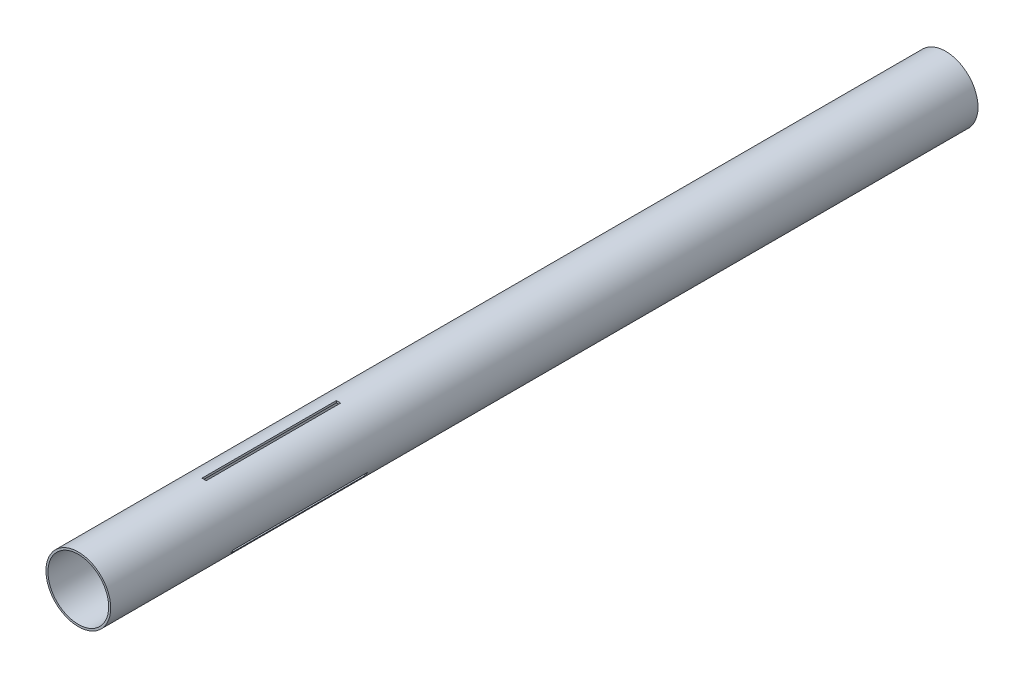
ISO-10303-21;
HEADER;
FILE_DESCRIPTION(('STEP AP214'),'2;1');
FILE_NAME('part.step','',(''),(''),'','','');
FILE_SCHEMA(('AUTOMOTIVE_DESIGN { 1 0 10303 214 1 1 1 1 }'));
ENDSEC;
DATA;
#1=APPLICATION_CONTEXT('core data for automotive mechanical design processes');
#2=APPLICATION_PROTOCOL_DEFINITION('international standard','automotive_design',2000,#1);
#3=PRODUCT_CONTEXT('',#1,'mechanical');
#4=PRODUCT('Part','Part','',(#3));
#5=PRODUCT_RELATED_PRODUCT_CATEGORY('part','',(#4));
#6=PRODUCT_DEFINITION_FORMATION('','',#4);
#7=PRODUCT_DEFINITION_CONTEXT('part definition',#1,'design');
#8=PRODUCT_DEFINITION('design','',#6,#7);
#9=PRODUCT_DEFINITION_SHAPE('','',#8);
#10=(LENGTH_UNIT() NAMED_UNIT(*) SI_UNIT(.MILLI.,.METRE.));
#11=(NAMED_UNIT(*) PLANE_ANGLE_UNIT() SI_UNIT($,.RADIAN.));
#12=(NAMED_UNIT(*) SI_UNIT($,.STERADIAN.) SOLID_ANGLE_UNIT());
#13=UNCERTAINTY_MEASURE_WITH_UNIT(LENGTH_MEASURE(1.E-05),#10,'distance_accuracy_value','');
#14=(GEOMETRIC_REPRESENTATION_CONTEXT(3) GLOBAL_UNCERTAINTY_ASSIGNED_CONTEXT((#13)) GLOBAL_UNIT_ASSIGNED_CONTEXT((#10,
#11,#12)) REPRESENTATION_CONTEXT('',''));
#15=CARTESIAN_POINT('',(0.,0.,0.));
#16=DIRECTION('',(0.,0.,1.));
#17=DIRECTION('',(1.,0.,0.));
#18=AXIS2_PLACEMENT_3D('',#15,#16,#17);
#19=CARTESIAN_POINT('',(0.,0.,635.));
#20=DIRECTION('',(0.,0.,1.));
#21=DIRECTION('',(1.,0.,0.));
#22=AXIS2_PLACEMENT_3D('',#19,#20,#21);
#23=PLANE('',#22);
#24=CARTESIAN_POINT('',(0.,0.,635.));
#25=DIRECTION('',(0.,0.,1.));
#26=DIRECTION('',(1.,0.,0.));
#27=AXIS2_PLACEMENT_3D('',#24,#25,#26);
#28=CIRCLE('',#27,23.6982);
#29=CARTESIAN_POINT('',(23.6982,0.,635.));
#30=VERTEX_POINT('',#29);
#31=EDGE_CURVE('E11',#30,#30,#28,.T.);
#32=ORIENTED_EDGE('',*,*,#31,.T.);
#33=EDGE_LOOP('',(#32));
#34=FACE_BOUND('',#33,.T.);
#35=CARTESIAN_POINT('',(0.,0.,635.));
#36=DIRECTION('',(0.,0.,1.));
#37=DIRECTION('',(1.,0.,0.));
#38=AXIS2_PLACEMENT_3D('',#35,#36,#37);
#39=CIRCLE('',#38,22.225);
#40=CARTESIAN_POINT('',(22.225,0.,635.));
#41=VERTEX_POINT('',#40);
#42=EDGE_CURVE('E225',#41,#41,#39,.T.);
#43=ORIENTED_EDGE('',*,*,#42,.F.);
#44=EDGE_LOOP('',(#43));
#45=FACE_BOUND('',#44,.T.);
#46=ADVANCED_FACE('F33',(#34,#45),#23,.T.);
#47=CARTESIAN_POINT('',(0.,0.,0.));
#48=DIRECTION('',(0.,0.,1.));
#49=DIRECTION('',(1.,0.,0.));
#50=AXIS2_PLACEMENT_3D('',#47,#48,#49);
#51=PLANE('',#50);
#52=CARTESIAN_POINT('',(0.,0.,0.));
#53=DIRECTION('',(0.,0.,1.));
#54=DIRECTION('',(1.,0.,0.));
#55=AXIS2_PLACEMENT_3D('',#52,#53,#54);
#56=CIRCLE('',#55,23.6982);
#57=CARTESIAN_POINT('',(23.6982,0.,0.));
#58=VERTEX_POINT('',#57);
#59=EDGE_CURVE('E37',#58,#58,#56,.T.);
#60=ORIENTED_EDGE('',*,*,#59,.F.);
#61=EDGE_LOOP('',(#60));
#62=FACE_BOUND('',#61,.T.);
#63=CARTESIAN_POINT('',(0.,0.,0.));
#64=DIRECTION('',(0.,0.,1.));
#65=DIRECTION('',(1.,0.,0.));
#66=AXIS2_PLACEMENT_3D('',#63,#64,#65);
#67=CIRCLE('',#66,22.225);
#68=CARTESIAN_POINT('',(22.225,0.,0.));
#69=VERTEX_POINT('',#68);
#70=EDGE_CURVE('E224',#69,#69,#67,.T.);
#71=ORIENTED_EDGE('',*,*,#70,.T.);
#72=EDGE_LOOP('',(#71));
#73=FACE_BOUND('',#72,.T.);
#74=ADVANCED_FACE('F231',(#62,#73),#51,.F.);
#75=CARTESIAN_POINT('',(0.,0.,635.));
#76=DIRECTION('',(0.,0.,-1.));
#77=DIRECTION('',(-1.,0.,0.));
#78=AXIS2_PLACEMENT_3D('',#75,#76,#77);
#79=CYLINDRICAL_SURFACE('',#78,23.6982);
#80=CARTESIAN_POINT('',(0.,0.,444.5));
#81=DIRECTION('',(0.,0.,-1.));
#82=DIRECTION('',(-1.,0.,0.));
#83=AXIS2_PLACEMENT_3D('',#80,#81,#82);
#84=CIRCLE('',#83,23.6982);
#85=CARTESIAN_POINT('',(-21.2708932392924,-10.4476688329323,444.5));
#86=VERTEX_POINT('',#85);
#87=CARTESIAN_POINT('',(-19.6833932392924,-13.1972994899479,444.5));
#88=VERTEX_POINT('',#87);
#89=EDGE_CURVE('E138',#86,#88,#84,.F.);
#90=ORIENTED_EDGE('',*,*,#89,.F.);
#91=DIRECTION('',(0.,0.,-1.));
#92=VECTOR('',#91,1.);
#93=CARTESIAN_POINT('',(-21.2708932392924,-10.4476688329323,635.));
#94=LINE('',#93,#92);
#95=CARTESIAN_POINT('',(-21.2708932392924,-10.4476688329323,542.925));
#96=VERTEX_POINT('',#95);
#97=EDGE_CURVE('E163',#96,#86,#94,.T.);
#98=ORIENTED_EDGE('',*,*,#97,.F.);
#99=CARTESIAN_POINT('',(0.,0.,542.925));
#100=DIRECTION('',(0.,0.,1.));
#101=DIRECTION('',(1.,0.,0.));
#102=AXIS2_PLACEMENT_3D('',#99,#100,#101);
#103=CIRCLE('',#102,23.6982);
#104=CARTESIAN_POINT('',(-19.6833932392924,-13.1972994899479,542.925));
#105=VERTEX_POINT('',#104);
#106=EDGE_CURVE('E155',#105,#96,#103,.F.);
#107=ORIENTED_EDGE('',*,*,#106,.F.);
#108=DIRECTION('',(0.,0.,-1.));
#109=VECTOR('',#108,1.);
#110=CARTESIAN_POINT('',(-19.6833932392924,-13.1972994899479,635.));
#111=LINE('',#110,#109);
#112=EDGE_CURVE('E48',#88,#105,#111,.F.);
#113=ORIENTED_EDGE('',*,*,#112,.F.);
#114=EDGE_LOOP('',(#90,#98,#107,#113));
#115=FACE_BOUND('',#114,.T.);
#116=CARTESIAN_POINT('',(0.,0.,444.5));
#117=DIRECTION('',(0.,0.,-1.));
#118=DIRECTION('',(-1.,0.,0.));
#119=AXIS2_PLACEMENT_3D('',#116,#117,#118);
#120=CIRCLE('',#119,23.6982);
#121=CARTESIAN_POINT('',(19.6833932392926,-13.1972994899476,444.5));
#122=VERTEX_POINT('',#121);
#123=CARTESIAN_POINT('',(21.2708932392925,-10.447668832932,444.5));
#124=VERTEX_POINT('',#123);
#125=EDGE_CURVE('E176',#122,#124,#120,.F.);
#126=ORIENTED_EDGE('',*,*,#125,.F.);
#127=DIRECTION('',(0.,0.,-1.));
#128=VECTOR('',#127,1.);
#129=CARTESIAN_POINT('',(19.6833932392926,-13.1972994899476,635.));
#130=LINE('',#129,#128);
#131=CARTESIAN_POINT('',(19.6833932392926,-13.1972994899476,542.925));
#132=VERTEX_POINT('',#131);
#133=EDGE_CURVE('E146',#132,#122,#130,.T.);
#134=ORIENTED_EDGE('',*,*,#133,.F.);
#135=CARTESIAN_POINT('',(0.,0.,542.925));
#136=DIRECTION('',(0.,0.,1.));
#137=DIRECTION('',(1.,0.,0.));
#138=AXIS2_PLACEMENT_3D('',#135,#136,#137);
#139=CIRCLE('',#138,23.6982);
#140=CARTESIAN_POINT('',(21.2708932392925,-10.447668832932,542.925));
#141=VERTEX_POINT('',#140);
#142=EDGE_CURVE('E180',#141,#132,#139,.F.);
#143=ORIENTED_EDGE('',*,*,#142,.F.);
#144=DIRECTION('',(0.,0.,-1.));
#145=VECTOR('',#144,1.);
#146=CARTESIAN_POINT('',(21.2708932392925,-10.447668832932,635.));
#147=LINE('',#146,#145);
#148=EDGE_CURVE('E56',#124,#141,#147,.F.);
#149=ORIENTED_EDGE('',*,*,#148,.F.);
#150=EDGE_LOOP('',(#126,#134,#143,#149));
#151=FACE_BOUND('',#150,.T.);
#152=CARTESIAN_POINT('',(0.,0.,444.5));
#153=DIRECTION('',(0.,0.,-1.));
#154=DIRECTION('',(-1.,0.,0.));
#155=AXIS2_PLACEMENT_3D('',#152,#153,#154);
#156=CIRCLE('',#155,23.6982);
#157=CARTESIAN_POINT('',(1.5875,23.64496832288,444.5));
#158=VERTEX_POINT('',#157);
#159=CARTESIAN_POINT('',(-1.5875,23.64496832288,444.5));
#160=VERTEX_POINT('',#159);
#161=EDGE_CURVE('E201',#158,#160,#156,.F.);
#162=ORIENTED_EDGE('',*,*,#161,.F.);
#163=DIRECTION('',(0.,0.,-1.));
#164=VECTOR('',#163,1.);
#165=CARTESIAN_POINT('',(1.5875,23.64496832288,635.));
#166=LINE('',#165,#164);
#167=CARTESIAN_POINT('',(1.5875,23.64496832288,542.925));
#168=VERTEX_POINT('',#167);
#169=EDGE_CURVE('E221',#168,#158,#166,.T.);
#170=ORIENTED_EDGE('',*,*,#169,.F.);
#171=CARTESIAN_POINT('',(0.,0.,542.925));
#172=DIRECTION('',(0.,0.,1.));
#173=DIRECTION('',(1.,0.,0.));
#174=AXIS2_PLACEMENT_3D('',#171,#172,#173);
#175=CIRCLE('',#174,23.6982);
#176=CARTESIAN_POINT('',(-1.5875,23.64496832288,542.925));
#177=VERTEX_POINT('',#176);
#178=EDGE_CURVE('E206',#177,#168,#175,.F.);
#179=ORIENTED_EDGE('',*,*,#178,.F.);
#180=DIRECTION('',(0.,0.,-1.));
#181=VECTOR('',#180,1.);
#182=CARTESIAN_POINT('',(-1.5875,23.64496832288,635.));
#183=LINE('',#182,#181);
#184=EDGE_CURVE('E204',#160,#177,#183,.F.);
#185=ORIENTED_EDGE('',*,*,#184,.F.);
#186=EDGE_LOOP('',(#162,#170,#179,#185));
#187=FACE_BOUND('',#186,.T.);
#188=ORIENTED_EDGE('',*,*,#31,.F.);
#189=EDGE_LOOP('',(#188));
#190=FACE_BOUND('',#189,.T.);
#191=ORIENTED_EDGE('',*,*,#59,.T.);
#192=EDGE_LOOP('',(#191));
#193=FACE_BOUND('',#192,.T.);
#194=ADVANCED_FACE('F35',(#115,#151,#187,#190,#193),#79,.T.);
#195=CARTESIAN_POINT('',(0.,0.,635.));
#196=DIRECTION('',(0.,0.,-1.));
#197=DIRECTION('',(-1.,0.,0.));
#198=AXIS2_PLACEMENT_3D('',#195,#196,#197);
#199=CYLINDRICAL_SURFACE('',#198,22.225);
#200=DIRECTION('',(0.,0.,-1.));
#201=VECTOR('',#200,1.);
#202=CARTESIAN_POINT('',(-19.9920012631359,-9.70930020623389,635.));
#203=LINE('',#202,#201);
#204=CARTESIAN_POINT('',(-19.9920012631359,-9.70930020623389,542.925));
#205=VERTEX_POINT('',#204);
#206=CARTESIAN_POINT('',(-19.9920012631359,-9.70930020623389,444.5));
#207=VERTEX_POINT('',#206);
#208=EDGE_CURVE('E145',#205,#207,#203,.T.);
#209=ORIENTED_EDGE('',*,*,#208,.T.);
#210=CARTESIAN_POINT('',(0.,0.,444.5));
#211=DIRECTION('',(0.,0.,-1.));
#212=DIRECTION('',(-1.,0.,0.));
#213=AXIS2_PLACEMENT_3D('',#210,#211,#212);
#214=CIRCLE('',#213,22.225);
#215=CARTESIAN_POINT('',(-18.4045012631359,-12.4589308632495,444.5));
#216=VERTEX_POINT('',#215);
#217=EDGE_CURVE('E132',#207,#216,#214,.F.);
#218=ORIENTED_EDGE('',*,*,#217,.T.);
#219=DIRECTION('',(0.,0.,-1.));
#220=VECTOR('',#219,1.);
#221=CARTESIAN_POINT('',(-18.4045012631359,-12.4589308632495,635.));
#222=LINE('',#221,#220);
#223=CARTESIAN_POINT('',(-18.4045012631359,-12.4589308632495,542.925));
#224=VERTEX_POINT('',#223);
#225=EDGE_CURVE('E122',#216,#224,#222,.F.);
#226=ORIENTED_EDGE('',*,*,#225,.T.);
#227=CARTESIAN_POINT('',(0.,0.,542.925));
#228=DIRECTION('',(0.,0.,1.));
#229=DIRECTION('',(1.,0.,0.));
#230=AXIS2_PLACEMENT_3D('',#227,#228,#229);
#231=CIRCLE('',#230,22.225);
#232=EDGE_CURVE('E131',#224,#205,#231,.F.);
#233=ORIENTED_EDGE('',*,*,#232,.T.);
#234=EDGE_LOOP('',(#209,#218,#226,#233));
#235=FACE_BOUND('',#234,.T.);
#236=DIRECTION('',(0.,0.,-1.));
#237=VECTOR('',#236,1.);
#238=CARTESIAN_POINT('',(18.404501263136,-12.4589308632492,635.));
#239=LINE('',#238,#237);
#240=CARTESIAN_POINT('',(18.404501263136,-12.4589308632492,542.925));
#241=VERTEX_POINT('',#240);
#242=CARTESIAN_POINT('',(18.404501263136,-12.4589308632492,444.5));
#243=VERTEX_POINT('',#242);
#244=EDGE_CURVE('E149',#241,#243,#239,.T.);
#245=ORIENTED_EDGE('',*,*,#244,.T.);
#246=CARTESIAN_POINT('',(0.,0.,444.5));
#247=DIRECTION('',(0.,0.,-1.));
#248=DIRECTION('',(-1.,0.,0.));
#249=AXIS2_PLACEMENT_3D('',#246,#247,#248);
#250=CIRCLE('',#249,22.225);
#251=CARTESIAN_POINT('',(19.992001263136,-9.70930020623361,444.5));
#252=VERTEX_POINT('',#251);
#253=EDGE_CURVE('E167',#243,#252,#250,.F.);
#254=ORIENTED_EDGE('',*,*,#253,.T.);
#255=DIRECTION('',(0.,0.,-1.));
#256=VECTOR('',#255,1.);
#257=CARTESIAN_POINT('',(19.992001263136,-9.70930020623361,635.));
#258=LINE('',#257,#256);
#259=CARTESIAN_POINT('',(19.992001263136,-9.70930020623361,542.925));
#260=VERTEX_POINT('',#259);
#261=EDGE_CURVE('E170',#252,#260,#258,.F.);
#262=ORIENTED_EDGE('',*,*,#261,.T.);
#263=CARTESIAN_POINT('',(0.,0.,542.925));
#264=DIRECTION('',(0.,0.,1.));
#265=DIRECTION('',(1.,0.,0.));
#266=AXIS2_PLACEMENT_3D('',#263,#264,#265);
#267=CIRCLE('',#266,22.225);
#268=EDGE_CURVE('E173',#260,#241,#267,.F.);
#269=ORIENTED_EDGE('',*,*,#268,.T.);
#270=EDGE_LOOP('',(#245,#254,#262,#269));
#271=FACE_BOUND('',#270,.T.);
#272=DIRECTION('',(0.,0.,-1.));
#273=VECTOR('',#272,1.);
#274=CARTESIAN_POINT('',(1.5875,22.1682310694832,635.));
#275=LINE('',#274,#273);
#276=CARTESIAN_POINT('',(1.5875,22.1682310694832,542.925));
#277=VERTEX_POINT('',#276);
#278=CARTESIAN_POINT('',(1.5875,22.1682310694832,444.5));
#279=VERTEX_POINT('',#278);
#280=EDGE_CURVE('E213',#277,#279,#275,.T.);
#281=ORIENTED_EDGE('',*,*,#280,.T.);
#282=CARTESIAN_POINT('',(0.,0.,444.5));
#283=DIRECTION('',(0.,0.,-1.));
#284=DIRECTION('',(-1.,0.,0.));
#285=AXIS2_PLACEMENT_3D('',#282,#283,#284);
#286=CIRCLE('',#285,22.225);
#287=CARTESIAN_POINT('',(-1.5875,22.1682310694832,444.5));
#288=VERTEX_POINT('',#287);
#289=EDGE_CURVE('E166',#279,#288,#286,.F.);
#290=ORIENTED_EDGE('',*,*,#289,.T.);
#291=DIRECTION('',(0.,0.,-1.));
#292=VECTOR('',#291,1.);
#293=CARTESIAN_POINT('',(-1.5875,22.1682310694832,635.));
#294=LINE('',#293,#292);
#295=CARTESIAN_POINT('',(-1.5875,22.1682310694832,542.925));
#296=VERTEX_POINT('',#295);
#297=EDGE_CURVE('E195',#288,#296,#294,.F.);
#298=ORIENTED_EDGE('',*,*,#297,.T.);
#299=CARTESIAN_POINT('',(0.,0.,542.925));
#300=DIRECTION('',(0.,0.,1.));
#301=DIRECTION('',(1.,0.,0.));
#302=AXIS2_PLACEMENT_3D('',#299,#300,#301);
#303=CIRCLE('',#302,22.225);
#304=EDGE_CURVE('E198',#296,#277,#303,.F.);
#305=ORIENTED_EDGE('',*,*,#304,.T.);
#306=EDGE_LOOP('',(#281,#290,#298,#305));
#307=FACE_BOUND('',#306,.T.);
#308=ORIENTED_EDGE('',*,*,#42,.T.);
#309=EDGE_LOOP('',(#308));
#310=FACE_BOUND('',#309,.T.);
#311=ORIENTED_EDGE('',*,*,#70,.F.);
#312=EDGE_LOOP('',(#311));
#313=FACE_BOUND('',#312,.T.);
#314=ADVANCED_FACE('F142',(#235,#271,#307,#310,#313),#199,.F.);
#315=CARTESIAN_POINT('',(1.5875,-23.6992,542.925));
#316=DIRECTION('',(1.,0.,0.));
#317=DIRECTION('',(0.,0.,-1.));
#318=AXIS2_PLACEMENT_3D('',#315,#316,#317);
#319=PLANE('',#318);
#320=ORIENTED_EDGE('',*,*,#169,.T.);
#321=DIRECTION('',(0.,1.,0.));
#322=VECTOR('',#321,1.);
#323=CARTESIAN_POINT('',(1.5875,-23.6992,444.5));
#324=LINE('',#323,#322);
#325=EDGE_CURVE('E216',#279,#158,#324,.T.);
#326=ORIENTED_EDGE('',*,*,#325,.F.);
#327=ORIENTED_EDGE('',*,*,#280,.F.);
#328=DIRECTION('',(0.,1.,0.));
#329=VECTOR('',#328,1.);
#330=CARTESIAN_POINT('',(1.5875,-23.6992,542.925));
#331=LINE('',#330,#329);
#332=EDGE_CURVE('E209',#277,#168,#331,.T.);
#333=ORIENTED_EDGE('',*,*,#332,.T.);
#334=EDGE_LOOP('',(#320,#326,#327,#333));
#335=FACE_BOUND('',#334,.T.);
#336=ADVANCED_FACE('F234',(#335),#319,.F.);
#337=CARTESIAN_POINT('',(-1.5875,-23.6992,444.5));
#338=DIRECTION('',(0.,0.,-1.));
#339=DIRECTION('',(-1.,0.,0.));
#340=AXIS2_PLACEMENT_3D('',#337,#338,#339);
#341=PLANE('',#340);
#342=ORIENTED_EDGE('',*,*,#161,.T.);
#343=DIRECTION('',(0.,1.,0.));
#344=VECTOR('',#343,1.);
#345=CARTESIAN_POINT('',(-1.5875,-23.6992,444.5));
#346=LINE('',#345,#344);
#347=EDGE_CURVE('E214',#288,#160,#346,.T.);
#348=ORIENTED_EDGE('',*,*,#347,.F.);
#349=ORIENTED_EDGE('',*,*,#289,.F.);
#350=ORIENTED_EDGE('',*,*,#325,.T.);
#351=EDGE_LOOP('',(#342,#348,#349,#350));
#352=FACE_BOUND('',#351,.T.);
#353=ADVANCED_FACE('F240',(#352),#341,.F.);
#354=CARTESIAN_POINT('',(-1.5875,-23.6992,542.925));
#355=DIRECTION('',(-1.,0.,0.));
#356=DIRECTION('',(0.,0.,1.));
#357=AXIS2_PLACEMENT_3D('',#354,#355,#356);
#358=PLANE('',#357);
#359=ORIENTED_EDGE('',*,*,#184,.T.);
#360=DIRECTION('',(0.,1.,0.));
#361=VECTOR('',#360,1.);
#362=CARTESIAN_POINT('',(-1.5875,-23.6992,542.925));
#363=LINE('',#362,#361);
#364=EDGE_CURVE('E210',#296,#177,#363,.T.);
#365=ORIENTED_EDGE('',*,*,#364,.F.);
#366=ORIENTED_EDGE('',*,*,#297,.F.);
#367=ORIENTED_EDGE('',*,*,#347,.T.);
#368=EDGE_LOOP('',(#359,#365,#366,#367));
#369=FACE_BOUND('',#368,.T.);
#370=ADVANCED_FACE('F358',(#369),#358,.F.);
#371=CARTESIAN_POINT('',(-1.5875,-23.6992,542.925));
#372=DIRECTION('',(0.,0.,1.));
#373=DIRECTION('',(1.,0.,0.));
#374=AXIS2_PLACEMENT_3D('',#371,#372,#373);
#375=PLANE('',#374);
#376=ORIENTED_EDGE('',*,*,#178,.T.);
#377=ORIENTED_EDGE('',*,*,#332,.F.);
#378=ORIENTED_EDGE('',*,*,#304,.F.);
#379=ORIENTED_EDGE('',*,*,#364,.T.);
#380=EDGE_LOOP('',(#376,#377,#378,#379));
#381=FACE_BOUND('',#380,.T.);
#382=ADVANCED_FACE('F273',(#381),#375,.F.);
#383=CARTESIAN_POINT('',(-28.8302046246841,14.812039296176,542.925));
#384=DIRECTION('',(-0.499999999999992,-0.866025403784443,0.));
#385=DIRECTION('',(0.866025403784443,-0.499999999999992,0.));
#386=AXIS2_PLACEMENT_3D('',#383,#384,#385);
#387=PLANE('',#386);
#388=ORIENTED_EDGE('',*,*,#133,.T.);
#389=DIRECTION('',(0.866025403784443,-0.499999999999992,0.));
#390=VECTOR('',#389,1.);
#391=CARTESIAN_POINT('',(-28.8302046246841,14.812039296176,444.5));
#392=LINE('',#391,#390);
#393=EDGE_CURVE('E188',#243,#122,#392,.T.);
#394=ORIENTED_EDGE('',*,*,#393,.F.);
#395=ORIENTED_EDGE('',*,*,#244,.F.);
#396=DIRECTION('',(0.866025403784443,-0.499999999999992,0.));
#397=VECTOR('',#396,1.);
#398=CARTESIAN_POINT('',(-28.8302046246841,14.812039296176,542.925));
#399=LINE('',#398,#397);
#400=EDGE_CURVE('E183',#241,#132,#399,.T.);
#401=ORIENTED_EDGE('',*,*,#400,.T.);
#402=EDGE_LOOP('',(#388,#394,#395,#401));
#403=FACE_BOUND('',#402,.T.);
#404=ADVANCED_FACE('F283',(#403),#387,.F.);
#405=CARTESIAN_POINT('',(-27.2427046246842,17.5616699531916,444.5));
#406=DIRECTION('',(0.,0.,-1.));
#407=DIRECTION('',(-1.,0.,0.));
#408=AXIS2_PLACEMENT_3D('',#405,#406,#407);
#409=PLANE('',#408);
#410=ORIENTED_EDGE('',*,*,#125,.T.);
#411=DIRECTION('',(0.866025403784443,-0.499999999999992,0.));
#412=VECTOR('',#411,1.);
#413=CARTESIAN_POINT('',(-27.2427046246842,17.5616699531916,444.5));
#414=LINE('',#413,#412);
#415=EDGE_CURVE('E186',#252,#124,#414,.T.);
#416=ORIENTED_EDGE('',*,*,#415,.F.);
#417=ORIENTED_EDGE('',*,*,#253,.F.);
#418=ORIENTED_EDGE('',*,*,#393,.T.);
#419=EDGE_LOOP('',(#410,#416,#417,#418));
#420=FACE_BOUND('',#419,.T.);
#421=ADVANCED_FACE('F288',(#420),#409,.F.);
#422=CARTESIAN_POINT('',(-27.2427046246842,17.5616699531916,542.925));
#423=DIRECTION('',(0.499999999999992,0.866025403784443,0.));
#424=DIRECTION('',(-0.866025403784443,0.499999999999992,0.));
#425=AXIS2_PLACEMENT_3D('',#422,#423,#424);
#426=PLANE('',#425);
#427=ORIENTED_EDGE('',*,*,#148,.T.);
#428=DIRECTION('',(0.866025403784443,-0.499999999999992,0.));
#429=VECTOR('',#428,1.);
#430=CARTESIAN_POINT('',(-27.2427046246842,17.5616699531916,542.925));
#431=LINE('',#430,#429);
#432=EDGE_CURVE('E184',#260,#141,#431,.T.);
#433=ORIENTED_EDGE('',*,*,#432,.F.);
#434=ORIENTED_EDGE('',*,*,#261,.F.);
#435=ORIENTED_EDGE('',*,*,#415,.T.);
#436=EDGE_LOOP('',(#427,#433,#434,#435));
#437=FACE_BOUND('',#436,.T.);
#438=ADVANCED_FACE('F298',(#437),#426,.F.);
#439=CARTESIAN_POINT('',(-27.2427046246842,17.5616699531916,542.925));
#440=DIRECTION('',(0.,0.,1.));
#441=DIRECTION('',(1.,0.,0.));
#442=AXIS2_PLACEMENT_3D('',#439,#440,#441);
#443=PLANE('',#442);
#444=ORIENTED_EDGE('',*,*,#142,.T.);
#445=ORIENTED_EDGE('',*,*,#400,.F.);
#446=ORIENTED_EDGE('',*,*,#268,.F.);
#447=ORIENTED_EDGE('',*,*,#432,.T.);
#448=EDGE_LOOP('',(#444,#445,#446,#447));
#449=FACE_BOUND('',#448,.T.);
#450=ADVANCED_FACE('F308',(#449),#443,.F.);
#451=CARTESIAN_POINT('',(27.242704624684,17.561669953192,542.925));
#452=DIRECTION('',(-0.500000000000004,0.866025403784436,0.));
#453=DIRECTION('',(-0.866025403784436,-0.500000000000004,0.));
#454=AXIS2_PLACEMENT_3D('',#451,#452,#453);
#455=PLANE('',#454);
#456=ORIENTED_EDGE('',*,*,#97,.T.);
#457=DIRECTION('',(-0.866025403784436,-0.500000000000004,0.));
#458=VECTOR('',#457,1.);
#459=CARTESIAN_POINT('',(27.242704624684,17.561669953192,444.5));
#460=LINE('',#459,#458);
#461=EDGE_CURVE('E139',#207,#86,#460,.T.);
#462=ORIENTED_EDGE('',*,*,#461,.F.);
#463=ORIENTED_EDGE('',*,*,#208,.F.);
#464=DIRECTION('',(-0.866025403784436,-0.500000000000004,0.));
#465=VECTOR('',#464,1.);
#466=CARTESIAN_POINT('',(27.242704624684,17.561669953192,542.925));
#467=LINE('',#466,#465);
#468=EDGE_CURVE('E158',#205,#96,#467,.T.);
#469=ORIENTED_EDGE('',*,*,#468,.T.);
#470=EDGE_LOOP('',(#456,#462,#463,#469));
#471=FACE_BOUND('',#470,.T.);
#472=ADVANCED_FACE('F317',(#471),#455,.F.);
#473=CARTESIAN_POINT('',(28.830204624684,14.8120392961764,444.5));
#474=DIRECTION('',(0.,0.,-1.));
#475=DIRECTION('',(-1.,0.,0.));
#476=AXIS2_PLACEMENT_3D('',#473,#474,#475);
#477=PLANE('',#476);
#478=ORIENTED_EDGE('',*,*,#89,.T.);
#479=DIRECTION('',(-0.866025403784436,-0.500000000000004,0.));
#480=VECTOR('',#479,1.);
#481=CARTESIAN_POINT('',(28.830204624684,14.8120392961764,444.5));
#482=LINE('',#481,#480);
#483=EDGE_CURVE('E125',#216,#88,#482,.T.);
#484=ORIENTED_EDGE('',*,*,#483,.F.);
#485=ORIENTED_EDGE('',*,*,#217,.F.);
#486=ORIENTED_EDGE('',*,*,#461,.T.);
#487=EDGE_LOOP('',(#478,#484,#485,#486));
#488=FACE_BOUND('',#487,.T.);
#489=ADVANCED_FACE('F135',(#488),#477,.F.);
#490=CARTESIAN_POINT('',(28.830204624684,14.8120392961764,542.925));
#491=DIRECTION('',(0.500000000000004,-0.866025403784436,0.));
#492=DIRECTION('',(0.866025403784436,0.500000000000004,0.));
#493=AXIS2_PLACEMENT_3D('',#490,#491,#492);
#494=PLANE('',#493);
#495=ORIENTED_EDGE('',*,*,#112,.T.);
#496=DIRECTION('',(-0.866025403784436,-0.500000000000004,0.));
#497=VECTOR('',#496,1.);
#498=CARTESIAN_POINT('',(28.830204624684,14.8120392961764,542.925));
#499=LINE('',#498,#497);
#500=EDGE_CURVE('E127',#224,#105,#499,.T.);
#501=ORIENTED_EDGE('',*,*,#500,.F.);
#502=ORIENTED_EDGE('',*,*,#225,.F.);
#503=ORIENTED_EDGE('',*,*,#483,.T.);
#504=EDGE_LOOP('',(#495,#501,#502,#503));
#505=FACE_BOUND('',#504,.T.);
#506=ADVANCED_FACE('F124',(#505),#494,.F.);
#507=CARTESIAN_POINT('',(28.830204624684,14.8120392961764,542.925));
#508=DIRECTION('',(0.,0.,1.));
#509=DIRECTION('',(1.,0.,0.));
#510=AXIS2_PLACEMENT_3D('',#507,#508,#509);
#511=PLANE('',#510);
#512=ORIENTED_EDGE('',*,*,#106,.T.);
#513=ORIENTED_EDGE('',*,*,#468,.F.);
#514=ORIENTED_EDGE('',*,*,#232,.F.);
#515=ORIENTED_EDGE('',*,*,#500,.T.);
#516=EDGE_LOOP('',(#512,#513,#514,#515));
#517=FACE_BOUND('',#516,.T.);
#518=ADVANCED_FACE('F344',(#517),#511,.F.);
#519=CLOSED_SHELL('',(#46,#74,#194,#314,#336,#353,#370,#382,#404,#421,#438,#450,#472,#489,#506,#518));
#520=MANIFOLD_SOLID_BREP('B2',#519);
#521=ADVANCED_BREP_SHAPE_REPRESENTATION('',(#18,#520),#14);
#522=SHAPE_DEFINITION_REPRESENTATION(#9,#521);
ENDSEC;
END-ISO-10303-21;
